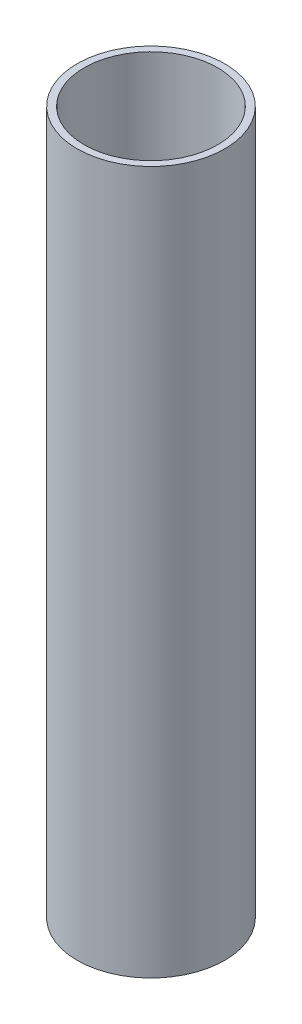
ISO-10303-21;
HEADER;
FILE_DESCRIPTION(('STEP AP214'),'2;1');
FILE_NAME('part.step','',(''),(''),'','','');
FILE_SCHEMA(('AUTOMOTIVE_DESIGN { 1 0 10303 214 1 1 1 1 }'));
ENDSEC;
DATA;
#1=APPLICATION_CONTEXT('core data for automotive mechanical design processes');
#2=APPLICATION_PROTOCOL_DEFINITION('international standard','automotive_design',2000,#1);
#3=PRODUCT_CONTEXT('',#1,'mechanical');
#4=PRODUCT('Part','Part','',(#3));
#5=PRODUCT_RELATED_PRODUCT_CATEGORY('part','',(#4));
#6=PRODUCT_DEFINITION_FORMATION('','',#4);
#7=PRODUCT_DEFINITION_CONTEXT('part definition',#1,'design');
#8=PRODUCT_DEFINITION('design','',#6,#7);
#9=PRODUCT_DEFINITION_SHAPE('','',#8);
#10=(LENGTH_UNIT() NAMED_UNIT(*) SI_UNIT(.MILLI.,.METRE.));
#11=(NAMED_UNIT(*) PLANE_ANGLE_UNIT() SI_UNIT($,.RADIAN.));
#12=(NAMED_UNIT(*) SI_UNIT($,.STERADIAN.) SOLID_ANGLE_UNIT());
#13=UNCERTAINTY_MEASURE_WITH_UNIT(LENGTH_MEASURE(1.E-05),#10,'distance_accuracy_value','');
#14=(GEOMETRIC_REPRESENTATION_CONTEXT(3) GLOBAL_UNCERTAINTY_ASSIGNED_CONTEXT((#13)) GLOBAL_UNIT_ASSIGNED_CONTEXT((#10,
#11,#12)) REPRESENTATION_CONTEXT('',''));
#15=CARTESIAN_POINT('',(0.,0.,0.));
#16=DIRECTION('',(0.,0.,1.));
#17=DIRECTION('',(1.,0.,0.));
#18=AXIS2_PLACEMENT_3D('',#15,#16,#17);
#19=CARTESIAN_POINT('',(0.,100.,0.));
#20=DIRECTION('',(0.,1.,0.));
#21=DIRECTION('',(0.,0.,1.));
#22=AXIS2_PLACEMENT_3D('',#19,#20,#21);
#23=PLANE('',#22);
#24=CARTESIAN_POINT('',(0.,100.,0.));
#25=DIRECTION('',(0.,1.,0.));
#26=DIRECTION('',(0.,0.,1.));
#27=AXIS2_PLACEMENT_3D('',#24,#25,#26);
#28=CIRCLE('',#27,10.5);
#29=CARTESIAN_POINT('',(0.,100.,10.5));
#30=VERTEX_POINT('',#29);
#31=EDGE_CURVE('E10',#30,#30,#28,.T.);
#32=ORIENTED_EDGE('',*,*,#31,.T.);
#33=EDGE_LOOP('',(#32));
#34=FACE_BOUND('',#33,.T.);
#35=CARTESIAN_POINT('',(0.,100.,0.));
#36=DIRECTION('',(0.,1.,0.));
#37=DIRECTION('',(0.,0.,1.));
#38=AXIS2_PLACEMENT_3D('',#35,#36,#37);
#39=CIRCLE('',#38,9.5);
#40=CARTESIAN_POINT('',(0.,100.,9.5));
#41=VERTEX_POINT('',#40);
#42=EDGE_CURVE('E42',#41,#41,#39,.T.);
#43=ORIENTED_EDGE('',*,*,#42,.F.);
#44=EDGE_LOOP('',(#43));
#45=FACE_BOUND('',#44,.T.);
#46=ADVANCED_FACE('F31',(#34,#45),#23,.T.);
#47=CARTESIAN_POINT('',(0.,0.,0.));
#48=DIRECTION('',(0.,1.,0.));
#49=DIRECTION('',(0.,0.,1.));
#50=AXIS2_PLACEMENT_3D('',#47,#48,#49);
#51=PLANE('',#50);
#52=CARTESIAN_POINT('',(0.,0.,0.));
#53=DIRECTION('',(0.,1.,0.));
#54=DIRECTION('',(0.,0.,1.));
#55=AXIS2_PLACEMENT_3D('',#52,#53,#54);
#56=CIRCLE('',#55,10.5);
#57=CARTESIAN_POINT('',(0.,0.,10.5));
#58=VERTEX_POINT('',#57);
#59=EDGE_CURVE('E35',#58,#58,#56,.T.);
#60=ORIENTED_EDGE('',*,*,#59,.F.);
#61=EDGE_LOOP('',(#60));
#62=FACE_BOUND('',#61,.T.);
#63=CARTESIAN_POINT('',(0.,0.,0.));
#64=DIRECTION('',(0.,1.,0.));
#65=DIRECTION('',(0.,0.,1.));
#66=AXIS2_PLACEMENT_3D('',#63,#64,#65);
#67=CIRCLE('',#66,9.5);
#68=CARTESIAN_POINT('',(0.,0.,9.5));
#69=VERTEX_POINT('',#68);
#70=EDGE_CURVE('E44',#69,#69,#67,.T.);
#71=ORIENTED_EDGE('',*,*,#70,.T.);
#72=EDGE_LOOP('',(#71));
#73=FACE_BOUND('',#72,.T.);
#74=ADVANCED_FACE('F54',(#62,#73),#51,.F.);
#75=CARTESIAN_POINT('',(0.,100.,0.));
#76=DIRECTION('',(0.,-1.,0.));
#77=DIRECTION('',(0.,0.,-1.));
#78=AXIS2_PLACEMENT_3D('',#75,#76,#77);
#79=CYLINDRICAL_SURFACE('',#78,10.5);
#80=ORIENTED_EDGE('',*,*,#31,.F.);
#81=EDGE_LOOP('',(#80));
#82=FACE_BOUND('',#81,.T.);
#83=ORIENTED_EDGE('',*,*,#59,.T.);
#84=EDGE_LOOP('',(#83));
#85=FACE_BOUND('',#84,.T.);
#86=ADVANCED_FACE('F33',(#82,#85),#79,.T.);
#87=CARTESIAN_POINT('',(0.,100.,0.));
#88=DIRECTION('',(0.,-1.,0.));
#89=DIRECTION('',(0.,0.,-1.));
#90=AXIS2_PLACEMENT_3D('',#87,#88,#89);
#91=CYLINDRICAL_SURFACE('',#90,9.5);
#92=ORIENTED_EDGE('',*,*,#42,.T.);
#93=EDGE_LOOP('',(#92));
#94=FACE_BOUND('',#93,.T.);
#95=ORIENTED_EDGE('',*,*,#70,.F.);
#96=EDGE_LOOP('',(#95));
#97=FACE_BOUND('',#96,.T.);
#98=ADVANCED_FACE('F50',(#94,#97),#91,.F.);
#99=CLOSED_SHELL('',(#46,#74,#86,#98));
#100=MANIFOLD_SOLID_BREP('B2',#99);
#101=ADVANCED_BREP_SHAPE_REPRESENTATION('',(#18,#100),#14);
#102=SHAPE_DEFINITION_REPRESENTATION(#9,#101);
ENDSEC;
END-ISO-10303-21;
